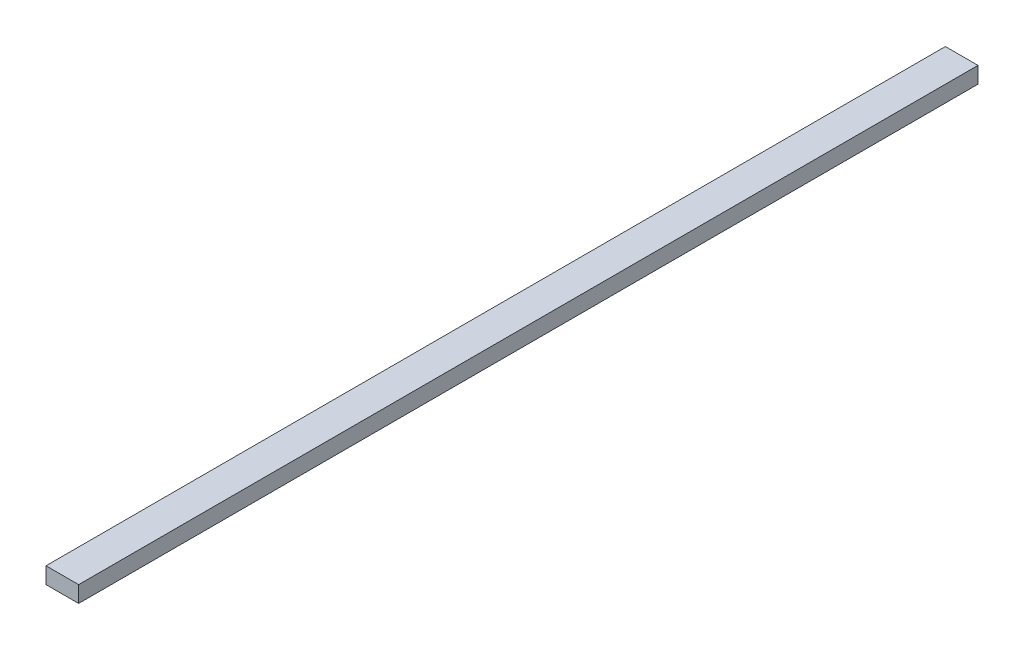
ISO-10303-21;
HEADER;
FILE_DESCRIPTION(('STEP AP214'),'2;1');
FILE_NAME('part.step','',(''),(''),'','','');
FILE_SCHEMA(('AUTOMOTIVE_DESIGN { 1 0 10303 214 1 1 1 1 }'));
ENDSEC;
DATA;
#1=APPLICATION_CONTEXT('core data for automotive mechanical design processes');
#2=APPLICATION_PROTOCOL_DEFINITION('international standard','automotive_design',2000,#1);
#3=PRODUCT_CONTEXT('',#1,'mechanical');
#4=PRODUCT('Part','Part','',(#3));
#5=PRODUCT_RELATED_PRODUCT_CATEGORY('part','',(#4));
#6=PRODUCT_DEFINITION_FORMATION('','',#4);
#7=PRODUCT_DEFINITION_CONTEXT('part definition',#1,'design');
#8=PRODUCT_DEFINITION('design','',#6,#7);
#9=PRODUCT_DEFINITION_SHAPE('','',#8);
#10=(LENGTH_UNIT() NAMED_UNIT(*) SI_UNIT(.MILLI.,.METRE.));
#11=(NAMED_UNIT(*) PLANE_ANGLE_UNIT() SI_UNIT($,.RADIAN.));
#12=(NAMED_UNIT(*) SI_UNIT($,.STERADIAN.) SOLID_ANGLE_UNIT());
#13=UNCERTAINTY_MEASURE_WITH_UNIT(LENGTH_MEASURE(1.E-05),#10,'distance_accuracy_value','');
#14=(GEOMETRIC_REPRESENTATION_CONTEXT(3) GLOBAL_UNCERTAINTY_ASSIGNED_CONTEXT((#13)) GLOBAL_UNIT_ASSIGNED_CONTEXT((#10,
#11,#12)) REPRESENTATION_CONTEXT('',''));
#15=CARTESIAN_POINT('',(0.,0.,0.));
#16=DIRECTION('',(0.,0.,1.));
#17=DIRECTION('',(1.,0.,0.));
#18=AXIS2_PLACEMENT_3D('',#15,#16,#17);
#19=CARTESIAN_POINT('',(-12.7,-6.35,-700.));
#20=DIRECTION('',(-1.,0.,0.));
#21=DIRECTION('',(0.,0.,1.));
#22=AXIS2_PLACEMENT_3D('',#19,#20,#21);
#23=PLANE('',#22);
#24=DIRECTION('',(0.,-1.,0.));
#25=VECTOR('',#24,1.);
#26=CARTESIAN_POINT('',(-12.7,-6.35,0.));
#27=LINE('',#26,#25);
#28=CARTESIAN_POINT('',(-12.7,6.35,0.));
#29=VERTEX_POINT('',#28);
#30=CARTESIAN_POINT('',(-12.7,-6.35,0.));
#31=VERTEX_POINT('',#30);
#32=EDGE_CURVE('E97',#29,#31,#27,.T.);
#33=ORIENTED_EDGE('',*,*,#32,.F.);
#34=DIRECTION('',(0.,0.,1.));
#35=VECTOR('',#34,1.);
#36=CARTESIAN_POINT('',(-12.7,6.35,-700.));
#37=LINE('',#36,#35);
#38=CARTESIAN_POINT('',(-12.7,6.35,-700.));
#39=VERTEX_POINT('',#38);
#40=EDGE_CURVE('E11',#39,#29,#37,.T.);
#41=ORIENTED_EDGE('',*,*,#40,.F.);
#42=DIRECTION('',(0.,-1.,0.));
#43=VECTOR('',#42,1.);
#44=CARTESIAN_POINT('',(-12.7,-6.35,-700.));
#45=LINE('',#44,#43);
#46=CARTESIAN_POINT('',(-12.7,-6.35,-700.));
#47=VERTEX_POINT('',#46);
#48=EDGE_CURVE('E91',#39,#47,#45,.T.);
#49=ORIENTED_EDGE('',*,*,#48,.T.);
#50=DIRECTION('',(0.,0.,1.));
#51=VECTOR('',#50,1.);
#52=CARTESIAN_POINT('',(-12.7,-6.35,-700.));
#53=LINE('',#52,#51);
#54=EDGE_CURVE('E36',#47,#31,#53,.T.);
#55=ORIENTED_EDGE('',*,*,#54,.T.);
#56=EDGE_LOOP('',(#33,#41,#49,#55));
#57=FACE_BOUND('',#56,.T.);
#58=ADVANCED_FACE('F33',(#57),#23,.T.);
#59=CARTESIAN_POINT('',(12.7,6.35,-700.));
#60=DIRECTION('',(0.,1.,0.));
#61=DIRECTION('',(-1.,0.,0.));
#62=AXIS2_PLACEMENT_3D('',#59,#60,#61);
#63=PLANE('',#62);
#64=DIRECTION('',(-1.,0.,0.));
#65=VECTOR('',#64,1.);
#66=CARTESIAN_POINT('',(12.7,6.35,0.));
#67=LINE('',#66,#65);
#68=CARTESIAN_POINT('',(12.7,6.35,0.));
#69=VERTEX_POINT('',#68);
#70=EDGE_CURVE('E93',#69,#29,#67,.T.);
#71=ORIENTED_EDGE('',*,*,#70,.F.);
#72=DIRECTION('',(0.,0.,1.));
#73=VECTOR('',#72,1.);
#74=CARTESIAN_POINT('',(12.7,6.35,-700.));
#75=LINE('',#74,#73);
#76=CARTESIAN_POINT('',(12.7,6.35,-700.));
#77=VERTEX_POINT('',#76);
#78=EDGE_CURVE('E42',#77,#69,#75,.T.);
#79=ORIENTED_EDGE('',*,*,#78,.F.);
#80=DIRECTION('',(-1.,0.,0.));
#81=VECTOR('',#80,1.);
#82=CARTESIAN_POINT('',(12.7,6.35,-700.));
#83=LINE('',#82,#81);
#84=EDGE_CURVE('E88',#77,#39,#83,.T.);
#85=ORIENTED_EDGE('',*,*,#84,.T.);
#86=ORIENTED_EDGE('',*,*,#40,.T.);
#87=EDGE_LOOP('',(#71,#79,#85,#86));
#88=FACE_BOUND('',#87,.T.);
#89=ADVANCED_FACE('F107',(#88),#63,.T.);
#90=CARTESIAN_POINT('',(12.7,-6.35,-700.));
#91=DIRECTION('',(1.,0.,0.));
#92=DIRECTION('',(0.,0.,-1.));
#93=AXIS2_PLACEMENT_3D('',#90,#91,#92);
#94=PLANE('',#93);
#95=DIRECTION('',(0.,1.,0.));
#96=VECTOR('',#95,1.);
#97=CARTESIAN_POINT('',(12.7,-6.35,0.));
#98=LINE('',#97,#96);
#99=CARTESIAN_POINT('',(12.7,-6.35,0.));
#100=VERTEX_POINT('',#99);
#101=EDGE_CURVE('E83',#100,#69,#98,.T.);
#102=ORIENTED_EDGE('',*,*,#101,.F.);
#103=DIRECTION('',(0.,0.,1.));
#104=VECTOR('',#103,1.);
#105=CARTESIAN_POINT('',(12.7,-6.35,-700.));
#106=LINE('',#105,#104);
#107=CARTESIAN_POINT('',(12.7,-6.35,-700.));
#108=VERTEX_POINT('',#107);
#109=EDGE_CURVE('E78',#108,#100,#106,.T.);
#110=ORIENTED_EDGE('',*,*,#109,.F.);
#111=DIRECTION('',(0.,1.,0.));
#112=VECTOR('',#111,1.);
#113=CARTESIAN_POINT('',(12.7,-6.35,-700.));
#114=LINE('',#113,#112);
#115=EDGE_CURVE('E81',#108,#77,#114,.T.);
#116=ORIENTED_EDGE('',*,*,#115,.T.);
#117=ORIENTED_EDGE('',*,*,#78,.T.);
#118=EDGE_LOOP('',(#102,#110,#116,#117));
#119=FACE_BOUND('',#118,.T.);
#120=ADVANCED_FACE('F80',(#119),#94,.T.);
#121=CARTESIAN_POINT('',(12.7,-6.35,-700.));
#122=DIRECTION('',(0.,-1.,0.));
#123=DIRECTION('',(1.,0.,0.));
#124=AXIS2_PLACEMENT_3D('',#121,#122,#123);
#125=PLANE('',#124);
#126=DIRECTION('',(1.,0.,0.));
#127=VECTOR('',#126,1.);
#128=CARTESIAN_POINT('',(12.7,-6.35,0.));
#129=LINE('',#128,#127);
#130=EDGE_CURVE('E100',#31,#100,#129,.T.);
#131=ORIENTED_EDGE('',*,*,#130,.F.);
#132=ORIENTED_EDGE('',*,*,#54,.F.);
#133=DIRECTION('',(1.,0.,0.));
#134=VECTOR('',#133,1.);
#135=CARTESIAN_POINT('',(12.7,-6.35,-700.));
#136=LINE('',#135,#134);
#137=EDGE_CURVE('E87',#47,#108,#136,.T.);
#138=ORIENTED_EDGE('',*,*,#137,.T.);
#139=ORIENTED_EDGE('',*,*,#109,.T.);
#140=EDGE_LOOP('',(#131,#132,#138,#139));
#141=FACE_BOUND('',#140,.T.);
#142=ADVANCED_FACE('F90',(#141),#125,.T.);
#143=CARTESIAN_POINT('',(0.,0.,-700.));
#144=DIRECTION('',(0.,0.,1.));
#145=DIRECTION('',(1.,0.,0.));
#146=AXIS2_PLACEMENT_3D('',#143,#144,#145);
#147=PLANE('',#146);
#148=ORIENTED_EDGE('',*,*,#48,.F.);
#149=ORIENTED_EDGE('',*,*,#84,.F.);
#150=ORIENTED_EDGE('',*,*,#115,.F.);
#151=ORIENTED_EDGE('',*,*,#137,.F.);
#152=EDGE_LOOP('',(#148,#149,#150,#151));
#153=FACE_BOUND('',#152,.T.);
#154=ADVANCED_FACE('F86',(#153),#147,.F.);
#155=CARTESIAN_POINT('',(0.,0.,0.));
#156=DIRECTION('',(0.,0.,1.));
#157=DIRECTION('',(1.,0.,0.));
#158=AXIS2_PLACEMENT_3D('',#155,#156,#157);
#159=PLANE('',#158);
#160=ORIENTED_EDGE('',*,*,#32,.T.);
#161=ORIENTED_EDGE('',*,*,#130,.T.);
#162=ORIENTED_EDGE('',*,*,#101,.T.);
#163=ORIENTED_EDGE('',*,*,#70,.T.);
#164=EDGE_LOOP('',(#160,#161,#162,#163));
#165=FACE_BOUND('',#164,.T.);
#166=ADVANCED_FACE('F106',(#165),#159,.T.);
#167=CLOSED_SHELL('',(#58,#89,#120,#142,#154,#166));
#168=MANIFOLD_SOLID_BREP('B2',#167);
#169=ADVANCED_BREP_SHAPE_REPRESENTATION('',(#18,#168),#14);
#170=SHAPE_DEFINITION_REPRESENTATION(#9,#169);
ENDSEC;
END-ISO-10303-21;
